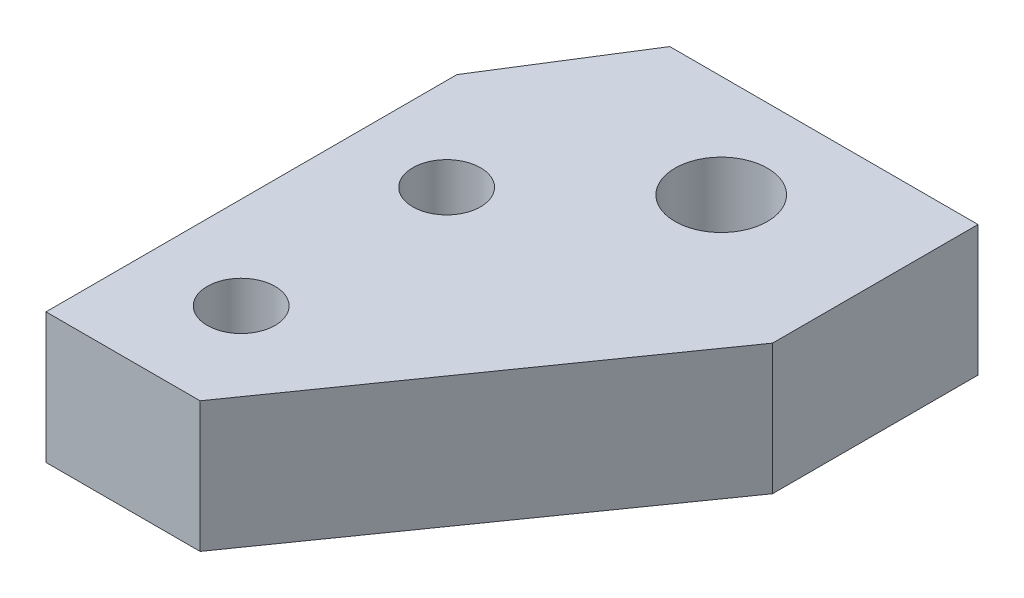
ISO-10303-21;
HEADER;
FILE_DESCRIPTION(('STEP AP214'),'2;1');
FILE_NAME('part.step','',(''),(''),'','','');
FILE_SCHEMA(('AUTOMOTIVE_DESIGN { 1 0 10303 214 1 1 1 1 }'));
ENDSEC;
DATA;
#1=APPLICATION_CONTEXT('core data for automotive mechanical design processes');
#2=APPLICATION_PROTOCOL_DEFINITION('international standard','automotive_design',2000,#1);
#3=PRODUCT_CONTEXT('',#1,'mechanical');
#4=PRODUCT('Part','Part','',(#3));
#5=PRODUCT_RELATED_PRODUCT_CATEGORY('part','',(#4));
#6=PRODUCT_DEFINITION_FORMATION('','',#4);
#7=PRODUCT_DEFINITION_CONTEXT('part definition',#1,'design');
#8=PRODUCT_DEFINITION('design','',#6,#7);
#9=PRODUCT_DEFINITION_SHAPE('','',#8);
#10=(LENGTH_UNIT() NAMED_UNIT(*) SI_UNIT(.MILLI.,.METRE.));
#11=(NAMED_UNIT(*) PLANE_ANGLE_UNIT() SI_UNIT($,.RADIAN.));
#12=(NAMED_UNIT(*) SI_UNIT($,.STERADIAN.) SOLID_ANGLE_UNIT());
#13=UNCERTAINTY_MEASURE_WITH_UNIT(LENGTH_MEASURE(1.E-05),#10,'distance_accuracy_value','');
#14=(GEOMETRIC_REPRESENTATION_CONTEXT(3) GLOBAL_UNCERTAINTY_ASSIGNED_CONTEXT((#13)) GLOBAL_UNIT_ASSIGNED_CONTEXT((#10,
#11,#12)) REPRESENTATION_CONTEXT('',''));
#15=CARTESIAN_POINT('',(0.,0.,0.));
#16=DIRECTION('',(0.,0.,1.));
#17=DIRECTION('',(1.,0.,0.));
#18=AXIS2_PLACEMENT_3D('',#15,#16,#17);
#19=CARTESIAN_POINT('',(7.5,3.175,0.));
#20=DIRECTION('',(0.,0.,-1.));
#21=DIRECTION('',(-1.,0.,0.));
#22=AXIS2_PLACEMENT_3D('',#19,#20,#21);
#23=PLANE('',#22);
#24=DIRECTION('',(1.,0.,0.));
#25=VECTOR('',#24,1.);
#26=CARTESIAN_POINT('',(7.5,-3.175,0.));
#27=LINE('',#26,#25);
#28=CARTESIAN_POINT('',(0.,-3.175,0.));
#29=VERTEX_POINT('',#28);
#30=CARTESIAN_POINT('',(7.5,-3.175,0.));
#31=VERTEX_POINT('',#30);
#32=EDGE_CURVE('E139',#29,#31,#27,.T.);
#33=ORIENTED_EDGE('',*,*,#32,.T.);
#34=DIRECTION('',(0.,-1.,0.));
#35=VECTOR('',#34,1.);
#36=CARTESIAN_POINT('',(7.5,3.175,0.));
#37=LINE('',#36,#35);
#38=CARTESIAN_POINT('',(7.5,3.175,0.));
#39=VERTEX_POINT('',#38);
#40=EDGE_CURVE('E11',#39,#31,#37,.T.);
#41=ORIENTED_EDGE('',*,*,#40,.F.);
#42=DIRECTION('',(1.,0.,0.));
#43=VECTOR('',#42,1.);
#44=CARTESIAN_POINT('',(7.5,3.175,0.));
#45=LINE('',#44,#43);
#46=CARTESIAN_POINT('',(0.,3.175,0.));
#47=VERTEX_POINT('',#46);
#48=EDGE_CURVE('E150',#47,#39,#45,.T.);
#49=ORIENTED_EDGE('',*,*,#48,.F.);
#50=DIRECTION('',(0.,-1.,0.));
#51=VECTOR('',#50,1.);
#52=CARTESIAN_POINT('',(0.,3.175,0.));
#53=LINE('',#52,#51);
#54=EDGE_CURVE('E135',#47,#29,#53,.T.);
#55=ORIENTED_EDGE('',*,*,#54,.T.);
#56=EDGE_LOOP('',(#33,#41,#49,#55));
#57=FACE_BOUND('',#56,.T.);
#58=ADVANCED_FACE('F55',(#57),#23,.F.);
#59=CARTESIAN_POINT('',(19.,3.175,-16.3630681719536));
#60=DIRECTION('',(-0.818153408597678,0.,-0.575));
#61=DIRECTION('',(-0.575,0.,0.818153408597678));
#62=AXIS2_PLACEMENT_3D('',#59,#60,#61);
#63=PLANE('',#62);
#64=DIRECTION('',(0.575,0.,-0.818153408597678));
#65=VECTOR('',#64,1.);
#66=CARTESIAN_POINT('',(19.,-3.175,-16.3630681719536));
#67=LINE('',#66,#65);
#68=CARTESIAN_POINT('',(19.,-3.175,-16.3630681719536));
#69=VERTEX_POINT('',#68);
#70=EDGE_CURVE('E142',#31,#69,#67,.T.);
#71=ORIENTED_EDGE('',*,*,#70,.T.);
#72=DIRECTION('',(0.,-1.,0.));
#73=VECTOR('',#72,1.);
#74=CARTESIAN_POINT('',(19.,3.175,-16.3630681719536));
#75=LINE('',#74,#73);
#76=CARTESIAN_POINT('',(19.,3.175,-16.3630681719536));
#77=VERTEX_POINT('',#76);
#78=EDGE_CURVE('E63',#77,#69,#75,.T.);
#79=ORIENTED_EDGE('',*,*,#78,.F.);
#80=DIRECTION('',(0.575,0.,-0.818153408597678));
#81=VECTOR('',#80,1.);
#82=CARTESIAN_POINT('',(19.,3.175,-16.3630681719536));
#83=LINE('',#82,#81);
#84=EDGE_CURVE('E108',#39,#77,#83,.T.);
#85=ORIENTED_EDGE('',*,*,#84,.F.);
#86=ORIENTED_EDGE('',*,*,#40,.T.);
#87=EDGE_LOOP('',(#71,#79,#85,#86));
#88=FACE_BOUND('',#87,.T.);
#89=ADVANCED_FACE('F176',(#88),#63,.F.);
#90=CARTESIAN_POINT('',(19.,3.175,-26.3630681719536));
#91=DIRECTION('',(-1.,0.,0.));
#92=DIRECTION('',(0.,0.,1.));
#93=AXIS2_PLACEMENT_3D('',#90,#91,#92);
#94=PLANE('',#93);
#95=DIRECTION('',(0.,0.,-1.));
#96=VECTOR('',#95,1.);
#97=CARTESIAN_POINT('',(19.,-3.175,-26.3630681719536));
#98=LINE('',#97,#96);
#99=CARTESIAN_POINT('',(19.,-3.175,-26.3630681719536));
#100=VERTEX_POINT('',#99);
#101=EDGE_CURVE('E145',#69,#100,#98,.T.);
#102=ORIENTED_EDGE('',*,*,#101,.T.);
#103=DIRECTION('',(0.,-1.,0.));
#104=VECTOR('',#103,1.);
#105=CARTESIAN_POINT('',(19.,3.175,-26.3630681719536));
#106=LINE('',#105,#104);
#107=CARTESIAN_POINT('',(19.,3.175,-26.3630681719536));
#108=VERTEX_POINT('',#107);
#109=EDGE_CURVE('E130',#108,#100,#106,.T.);
#110=ORIENTED_EDGE('',*,*,#109,.F.);
#111=DIRECTION('',(0.,0.,-1.));
#112=VECTOR('',#111,1.);
#113=CARTESIAN_POINT('',(19.,3.175,-26.3630681719536));
#114=LINE('',#113,#112);
#115=EDGE_CURVE('E121',#77,#108,#114,.T.);
#116=ORIENTED_EDGE('',*,*,#115,.F.);
#117=ORIENTED_EDGE('',*,*,#78,.T.);
#118=EDGE_LOOP('',(#102,#110,#116,#117));
#119=FACE_BOUND('',#118,.T.);
#120=ADVANCED_FACE('F156',(#119),#94,.F.);
#121=CARTESIAN_POINT('',(4.,3.175,-26.3630681719536));
#122=DIRECTION('',(0.,0.,1.));
#123=DIRECTION('',(1.,0.,0.));
#124=AXIS2_PLACEMENT_3D('',#121,#122,#123);
#125=PLANE('',#124);
#126=DIRECTION('',(-1.,0.,0.));
#127=VECTOR('',#126,1.);
#128=CARTESIAN_POINT('',(4.,-3.175,-26.3630681719536));
#129=LINE('',#128,#127);
#130=CARTESIAN_POINT('',(4.,-3.175,-26.3630681719536));
#131=VERTEX_POINT('',#130);
#132=EDGE_CURVE('E129',#100,#131,#129,.T.);
#133=ORIENTED_EDGE('',*,*,#132,.T.);
#134=DIRECTION('',(0.,-1.,0.));
#135=VECTOR('',#134,1.);
#136=CARTESIAN_POINT('',(4.,3.175,-26.3630681719536));
#137=LINE('',#136,#135);
#138=CARTESIAN_POINT('',(4.,3.175,-26.3630681719536));
#139=VERTEX_POINT('',#138);
#140=EDGE_CURVE('E126',#139,#131,#137,.T.);
#141=ORIENTED_EDGE('',*,*,#140,.F.);
#142=DIRECTION('',(-1.,0.,0.));
#143=VECTOR('',#142,1.);
#144=CARTESIAN_POINT('',(4.,3.175,-26.3630681719536));
#145=LINE('',#144,#143);
#146=EDGE_CURVE('E115',#108,#139,#145,.T.);
#147=ORIENTED_EDGE('',*,*,#146,.F.);
#148=ORIENTED_EDGE('',*,*,#109,.T.);
#149=EDGE_LOOP('',(#133,#141,#147,#148));
#150=FACE_BOUND('',#149,.T.);
#151=ADVANCED_FACE('F127',(#150),#125,.F.);
#152=CARTESIAN_POINT('',(0.,3.175,-20.));
#153=DIRECTION('',(0.846615138478626,0.,0.532205606226406));
#154=DIRECTION('',(0.532205606226406,0.,-0.846615138478626));
#155=AXIS2_PLACEMENT_3D('',#152,#153,#154);
#156=PLANE('',#155);
#157=DIRECTION('',(-0.532205606226406,0.,0.846615138478626));
#158=VECTOR('',#157,1.);
#159=CARTESIAN_POINT('',(0.,-3.175,-20.));
#160=LINE('',#159,#158);
#161=CARTESIAN_POINT('',(0.,-3.175,-20.));
#162=VERTEX_POINT('',#161);
#163=EDGE_CURVE('E94',#131,#162,#160,.T.);
#164=ORIENTED_EDGE('',*,*,#163,.T.);
#165=DIRECTION('',(0.,-1.,0.));
#166=VECTOR('',#165,1.);
#167=CARTESIAN_POINT('',(0.,3.175,-20.));
#168=LINE('',#167,#166);
#169=CARTESIAN_POINT('',(0.,3.175,-20.));
#170=VERTEX_POINT('',#169);
#171=EDGE_CURVE('E131',#170,#162,#168,.T.);
#172=ORIENTED_EDGE('',*,*,#171,.F.);
#173=DIRECTION('',(-0.532205606226406,0.,0.846615138478626));
#174=VECTOR('',#173,1.);
#175=CARTESIAN_POINT('',(0.,3.175,-20.));
#176=LINE('',#175,#174);
#177=EDGE_CURVE('E119',#139,#170,#176,.T.);
#178=ORIENTED_EDGE('',*,*,#177,.F.);
#179=ORIENTED_EDGE('',*,*,#140,.T.);
#180=EDGE_LOOP('',(#164,#172,#178,#179));
#181=FACE_BOUND('',#180,.T.);
#182=ADVANCED_FACE('F133',(#181),#156,.F.);
#183=CARTESIAN_POINT('',(0.,3.175,0.));
#184=DIRECTION('',(1.,0.,0.));
#185=DIRECTION('',(0.,0.,-1.));
#186=AXIS2_PLACEMENT_3D('',#183,#184,#185);
#187=PLANE('',#186);
#188=DIRECTION('',(0.,0.,1.));
#189=VECTOR('',#188,1.);
#190=CARTESIAN_POINT('',(0.,-3.175,0.));
#191=LINE('',#190,#189);
#192=EDGE_CURVE('E100',#162,#29,#191,.T.);
#193=ORIENTED_EDGE('',*,*,#192,.T.);
#194=ORIENTED_EDGE('',*,*,#54,.F.);
#195=DIRECTION('',(0.,0.,1.));
#196=VECTOR('',#195,1.);
#197=CARTESIAN_POINT('',(0.,3.175,0.));
#198=LINE('',#197,#196);
#199=EDGE_CURVE('E71',#170,#47,#198,.T.);
#200=ORIENTED_EDGE('',*,*,#199,.F.);
#201=ORIENTED_EDGE('',*,*,#171,.T.);
#202=EDGE_LOOP('',(#193,#194,#200,#201));
#203=FACE_BOUND('',#202,.T.);
#204=ADVANCED_FACE('F163',(#203),#187,.F.);
#205=CARTESIAN_POINT('',(0.,3.175,0.));
#206=DIRECTION('',(0.,-1.,0.));
#207=DIRECTION('',(0.,0.,-1.));
#208=AXIS2_PLACEMENT_3D('',#205,#206,#207);
#209=PLANE('',#208);
#210=CARTESIAN_POINT('',(11.5,3.175,-21.3644712743414));
#211=DIRECTION('',(0.,1.,0.));
#212=DIRECTION('',(0.,0.,1.));
#213=AXIS2_PLACEMENT_3D('',#210,#211,#212);
#214=CIRCLE('',#213,2.25);
#215=CARTESIAN_POINT('',(11.5,3.175,-19.1144712743414));
#216=VERTEX_POINT('',#215);
#217=EDGE_CURVE('E245',#216,#216,#214,.T.);
#218=ORIENTED_EDGE('',*,*,#217,.F.);
#219=EDGE_LOOP('',(#218));
#220=FACE_BOUND('',#219,.T.);
#221=CARTESIAN_POINT('',(4.49999955296419,3.175,-15.0000000000017));
#222=DIRECTION('',(0.,1.,0.));
#223=DIRECTION('',(0.,0.,1.));
#224=AXIS2_PLACEMENT_3D('',#221,#222,#223);
#225=CIRCLE('',#224,1.65);
#226=CARTESIAN_POINT('',(4.49999955296419,3.175,-13.3500000000017));
#227=VERTEX_POINT('',#226);
#228=EDGE_CURVE('E247',#227,#227,#225,.T.);
#229=ORIENTED_EDGE('',*,*,#228,.F.);
#230=EDGE_LOOP('',(#229));
#231=FACE_BOUND('',#230,.T.);
#232=CARTESIAN_POINT('',(4.49999955296419,3.175,-5.00000000000168));
#233=DIRECTION('',(0.,1.,0.));
#234=DIRECTION('',(0.,0.,1.));
#235=AXIS2_PLACEMENT_3D('',#232,#233,#234);
#236=CIRCLE('',#235,1.65);
#237=CARTESIAN_POINT('',(4.49999955296419,3.175,-3.35000000000168));
#238=VERTEX_POINT('',#237);
#239=EDGE_CURVE('E255',#238,#238,#236,.T.);
#240=ORIENTED_EDGE('',*,*,#239,.F.);
#241=EDGE_LOOP('',(#240));
#242=FACE_BOUND('',#241,.T.);
#243=ORIENTED_EDGE('',*,*,#48,.T.);
#244=ORIENTED_EDGE('',*,*,#84,.T.);
#245=ORIENTED_EDGE('',*,*,#115,.T.);
#246=ORIENTED_EDGE('',*,*,#146,.T.);
#247=ORIENTED_EDGE('',*,*,#177,.T.);
#248=ORIENTED_EDGE('',*,*,#199,.T.);
#249=EDGE_LOOP('',(#243,#244,#245,#246,#247,#248));
#250=FACE_BOUND('',#249,.T.);
#251=ADVANCED_FACE('F117',(#220,#231,#242,#250),#209,.F.);
#252=CARTESIAN_POINT('',(0.,-3.175,0.));
#253=DIRECTION('',(0.,-1.,0.));
#254=DIRECTION('',(0.,0.,-1.));
#255=AXIS2_PLACEMENT_3D('',#252,#253,#254);
#256=PLANE('',#255);
#257=CARTESIAN_POINT('',(11.5,-3.175,-21.3644712743414));
#258=DIRECTION('',(0.,1.,0.));
#259=DIRECTION('',(0.,0.,1.));
#260=AXIS2_PLACEMENT_3D('',#257,#258,#259);
#261=CIRCLE('',#260,2.25);
#262=CARTESIAN_POINT('',(11.5,-3.175,-19.1144712743414));
#263=VERTEX_POINT('',#262);
#264=EDGE_CURVE('E242',#263,#263,#261,.T.);
#265=ORIENTED_EDGE('',*,*,#264,.T.);
#266=EDGE_LOOP('',(#265));
#267=FACE_BOUND('',#266,.T.);
#268=CARTESIAN_POINT('',(4.49999955296419,-3.175,-15.0000000000017));
#269=DIRECTION('',(0.,1.,0.));
#270=DIRECTION('',(0.,0.,1.));
#271=AXIS2_PLACEMENT_3D('',#268,#269,#270);
#272=CIRCLE('',#271,1.65);
#273=CARTESIAN_POINT('',(4.49999955296419,-3.175,-13.3500000000017));
#274=VERTEX_POINT('',#273);
#275=EDGE_CURVE('E252',#274,#274,#272,.T.);
#276=ORIENTED_EDGE('',*,*,#275,.T.);
#277=EDGE_LOOP('',(#276));
#278=FACE_BOUND('',#277,.T.);
#279=CARTESIAN_POINT('',(4.49999955296419,-3.175,-5.00000000000168));
#280=DIRECTION('',(0.,1.,0.));
#281=DIRECTION('',(0.,0.,1.));
#282=AXIS2_PLACEMENT_3D('',#279,#280,#281);
#283=CIRCLE('',#282,1.65);
#284=CARTESIAN_POINT('',(4.49999955296419,-3.175,-3.35000000000168));
#285=VERTEX_POINT('',#284);
#286=EDGE_CURVE('E143',#285,#285,#283,.T.);
#287=ORIENTED_EDGE('',*,*,#286,.T.);
#288=EDGE_LOOP('',(#287));
#289=FACE_BOUND('',#288,.T.);
#290=ORIENTED_EDGE('',*,*,#32,.F.);
#291=ORIENTED_EDGE('',*,*,#192,.F.);
#292=ORIENTED_EDGE('',*,*,#163,.F.);
#293=ORIENTED_EDGE('',*,*,#132,.F.);
#294=ORIENTED_EDGE('',*,*,#101,.F.);
#295=ORIENTED_EDGE('',*,*,#70,.F.);
#296=EDGE_LOOP('',(#290,#291,#292,#293,#294,#295));
#297=FACE_BOUND('',#296,.T.);
#298=ADVANCED_FACE('F159',(#267,#278,#289,#297),#256,.T.);
#299=CARTESIAN_POINT('',(4.49999955296419,3.175,-5.00000000000168));
#300=DIRECTION('',(0.,1.,0.));
#301=DIRECTION('',(0.,0.,1.));
#302=AXIS2_PLACEMENT_3D('',#299,#300,#301);
#303=CYLINDRICAL_SURFACE('',#302,1.65);
#304=ORIENTED_EDGE('',*,*,#286,.F.);
#305=EDGE_LOOP('',(#304));
#306=FACE_BOUND('',#305,.T.);
#307=ORIENTED_EDGE('',*,*,#239,.T.);
#308=EDGE_LOOP('',(#307));
#309=FACE_BOUND('',#308,.T.);
#310=ADVANCED_FACE('F211',(#306,#309),#303,.F.);
#311=CARTESIAN_POINT('',(4.49999955296419,3.175,-15.0000000000017));
#312=DIRECTION('',(0.,1.,0.));
#313=DIRECTION('',(0.,0.,1.));
#314=AXIS2_PLACEMENT_3D('',#311,#312,#313);
#315=CYLINDRICAL_SURFACE('',#314,1.65);
#316=ORIENTED_EDGE('',*,*,#275,.F.);
#317=EDGE_LOOP('',(#316));
#318=FACE_BOUND('',#317,.T.);
#319=ORIENTED_EDGE('',*,*,#228,.T.);
#320=EDGE_LOOP('',(#319));
#321=FACE_BOUND('',#320,.T.);
#322=ADVANCED_FACE('F219',(#318,#321),#315,.F.);
#323=CARTESIAN_POINT('',(11.5,3.175,-21.3644712743414));
#324=DIRECTION('',(0.,1.,0.));
#325=DIRECTION('',(0.,0.,1.));
#326=AXIS2_PLACEMENT_3D('',#323,#324,#325);
#327=CYLINDRICAL_SURFACE('',#326,2.25);
#328=ORIENTED_EDGE('',*,*,#264,.F.);
#329=EDGE_LOOP('',(#328));
#330=FACE_BOUND('',#329,.T.);
#331=ORIENTED_EDGE('',*,*,#217,.T.);
#332=EDGE_LOOP('',(#331));
#333=FACE_BOUND('',#332,.T.);
#334=ADVANCED_FACE('F229',(#330,#333),#327,.F.);
#335=CLOSED_SHELL('',(#58,#89,#120,#151,#182,#204,#251,#298,#310,#322,#334));
#336=MANIFOLD_SOLID_BREP('B2',#335);
#337=ADVANCED_BREP_SHAPE_REPRESENTATION('',(#18,#336),#14);
#338=SHAPE_DEFINITION_REPRESENTATION(#9,#337);
ENDSEC;
END-ISO-10303-21;
